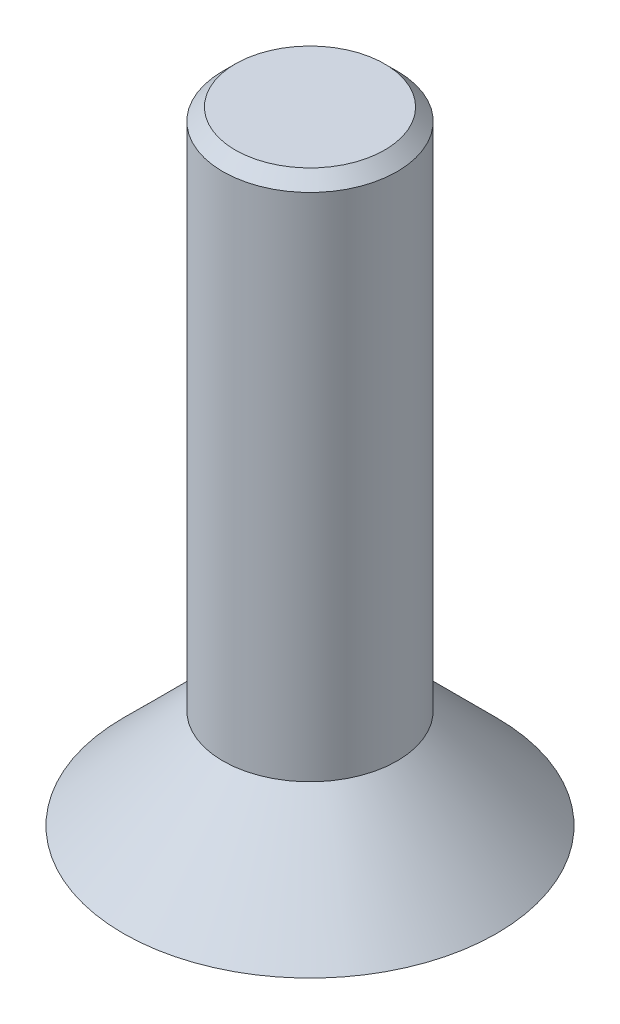
ISO-10303-21;
HEADER;
FILE_DESCRIPTION(('STEP AP214'),'2;1');
FILE_NAME('part.step','',(''),(''),'','','');
FILE_SCHEMA(('AUTOMOTIVE_DESIGN { 1 0 10303 214 1 1 1 1 }'));
ENDSEC;
DATA;
#1=APPLICATION_CONTEXT('core data for automotive mechanical design processes');
#2=APPLICATION_PROTOCOL_DEFINITION('international standard','automotive_design',2000,#1);
#3=PRODUCT_CONTEXT('',#1,'mechanical');
#4=PRODUCT('Part','Part','',(#3));
#5=PRODUCT_RELATED_PRODUCT_CATEGORY('part','',(#4));
#6=PRODUCT_DEFINITION_FORMATION('','',#4);
#7=PRODUCT_DEFINITION_CONTEXT('part definition',#1,'design');
#8=PRODUCT_DEFINITION('design','',#6,#7);
#9=PRODUCT_DEFINITION_SHAPE('','',#8);
#10=(LENGTH_UNIT() NAMED_UNIT(*) SI_UNIT(.MILLI.,.METRE.));
#11=(NAMED_UNIT(*) PLANE_ANGLE_UNIT() SI_UNIT($,.RADIAN.));
#12=(NAMED_UNIT(*) SI_UNIT($,.STERADIAN.) SOLID_ANGLE_UNIT());
#13=UNCERTAINTY_MEASURE_WITH_UNIT(LENGTH_MEASURE(1.E-05),#10,'distance_accuracy_value','');
#14=(GEOMETRIC_REPRESENTATION_CONTEXT(3) GLOBAL_UNCERTAINTY_ASSIGNED_CONTEXT((#13)) GLOBAL_UNIT_ASSIGNED_CONTEXT((#10,
#11,#12)) REPRESENTATION_CONTEXT('',''));
#15=CARTESIAN_POINT('',(0.,0.,0.));
#16=DIRECTION('',(0.,0.,1.));
#17=DIRECTION('',(1.,0.,0.));
#18=AXIS2_PLACEMENT_3D('',#15,#16,#17);
#19=CARTESIAN_POINT('',(0.,0.,0.));
#20=DIRECTION('',(0.,1.,0.));
#21=DIRECTION('',(0.,0.,1.));
#22=AXIS2_PLACEMENT_3D('',#19,#20,#21);
#23=PLANE('',#22);
#24=CARTESIAN_POINT('',(0.,0.,0.));
#25=DIRECTION('',(0.,1.,0.));
#26=DIRECTION('',(0.,0.,1.));
#27=AXIS2_PLACEMENT_3D('',#24,#25,#26);
#28=CIRCLE('',#27,3.);
#29=CARTESIAN_POINT('',(0.,0.,3.));
#30=VERTEX_POINT('',#29);
#31=EDGE_CURVE('E127',#30,#30,#28,.T.);
#32=ORIENTED_EDGE('',*,*,#31,.F.);
#33=EDGE_LOOP('',(#32));
#34=FACE_BOUND('',#33,.T.);
#35=DIRECTION('',(0.866025403784439,0.,0.5));
#36=VECTOR('',#35,1.);
#37=CARTESIAN_POINT('',(-1.,0.,0.577350269189626));
#38=LINE('',#37,#36);
#39=CARTESIAN_POINT('',(-1.,0.,0.577350269189626));
#40=VERTEX_POINT('',#39);
#41=CARTESIAN_POINT('',(0.,0.,1.15470053837925));
#42=VERTEX_POINT('',#41);
#43=EDGE_CURVE('E56',#40,#42,#38,.T.);
#44=ORIENTED_EDGE('',*,*,#43,.T.);
#45=DIRECTION('',(0.866025403784438,0.,-0.5));
#46=VECTOR('',#45,1.);
#47=CARTESIAN_POINT('',(0.,0.,1.15470053837925));
#48=LINE('',#47,#46);
#49=CARTESIAN_POINT('',(1.,0.,0.577350269189626));
#50=VERTEX_POINT('',#49);
#51=EDGE_CURVE('E112',#42,#50,#48,.T.);
#52=ORIENTED_EDGE('',*,*,#51,.T.);
#53=DIRECTION('',(0.,0.,-1.));
#54=VECTOR('',#53,1.);
#55=CARTESIAN_POINT('',(1.,0.,0.577350269189626));
#56=LINE('',#55,#54);
#57=CARTESIAN_POINT('',(0.999999999999999,0.,-0.577350269189626));
#58=VERTEX_POINT('',#57);
#59=EDGE_CURVE('E110',#50,#58,#56,.T.);
#60=ORIENTED_EDGE('',*,*,#59,.T.);
#61=DIRECTION('',(-0.866025403784439,0.,-0.5));
#62=VECTOR('',#61,1.);
#63=CARTESIAN_POINT('',(0.999999999999999,0.,-0.577350269189626));
#64=LINE('',#63,#62);
#65=CARTESIAN_POINT('',(0.,0.,-1.15470053837925));
#66=VERTEX_POINT('',#65);
#67=EDGE_CURVE('E91',#58,#66,#64,.T.);
#68=ORIENTED_EDGE('',*,*,#67,.T.);
#69=DIRECTION('',(-0.866025403784438,0.,0.5));
#70=VECTOR('',#69,1.);
#71=CARTESIAN_POINT('',(0.,0.,-1.15470053837925));
#72=LINE('',#71,#70);
#73=CARTESIAN_POINT('',(-1.,0.,-0.577350269189625));
#74=VERTEX_POINT('',#73);
#75=EDGE_CURVE('E100',#66,#74,#72,.T.);
#76=ORIENTED_EDGE('',*,*,#75,.T.);
#77=DIRECTION('',(0.,0.,1.));
#78=VECTOR('',#77,1.);
#79=CARTESIAN_POINT('',(-1.,0.,-0.577350269189625));
#80=LINE('',#79,#78);
#81=EDGE_CURVE('E106',#74,#40,#80,.T.);
#82=ORIENTED_EDGE('',*,*,#81,.T.);
#83=EDGE_LOOP('',(#44,#52,#60,#68,#76,#82));
#84=FACE_BOUND('',#83,.T.);
#85=ADVANCED_FACE('F40',(#34,#84),#23,.F.);
#86=CARTESIAN_POINT('',(-1.,1.6,0.577350269189626));
#87=DIRECTION('',(0.5,0.,-0.866025403784439));
#88=DIRECTION('',(-0.866025403784439,0.,-0.5));
#89=AXIS2_PLACEMENT_3D('',#86,#87,#88);
#90=PLANE('',#89);
#91=ORIENTED_EDGE('',*,*,#43,.F.);
#92=DIRECTION('',(0.,-1.,0.));
#93=VECTOR('',#92,1.);
#94=CARTESIAN_POINT('',(-1.,1.6,0.577350269189626));
#95=LINE('',#94,#93);
#96=CARTESIAN_POINT('',(-1.,1.6,0.577350269189626));
#97=VERTEX_POINT('',#96);
#98=EDGE_CURVE('E118',#97,#40,#95,.T.);
#99=ORIENTED_EDGE('',*,*,#98,.F.);
#100=DIRECTION('',(0.866025403784439,0.,0.5));
#101=VECTOR('',#100,1.);
#102=CARTESIAN_POINT('',(-1.,1.6,0.577350269189626));
#103=LINE('',#102,#101);
#104=CARTESIAN_POINT('',(0.,1.6,1.15470053837925));
#105=VERTEX_POINT('',#104);
#106=EDGE_CURVE('E117',#97,#105,#103,.T.);
#107=ORIENTED_EDGE('',*,*,#106,.T.);
#108=DIRECTION('',(0.,-1.,0.));
#109=VECTOR('',#108,1.);
#110=CARTESIAN_POINT('',(0.,1.6,1.15470053837925));
#111=LINE('',#110,#109);
#112=EDGE_CURVE('E125',#105,#42,#111,.T.);
#113=ORIENTED_EDGE('',*,*,#112,.T.);
#114=EDGE_LOOP('',(#91,#99,#107,#113));
#115=FACE_BOUND('',#114,.T.);
#116=ADVANCED_FACE('F146',(#115),#90,.T.);
#117=CARTESIAN_POINT('',(0.,1.6,1.15470053837925));
#118=DIRECTION('',(-0.5,0.,-0.866025403784438));
#119=DIRECTION('',(-0.866025403784439,0.,0.5));
#120=AXIS2_PLACEMENT_3D('',#117,#118,#119);
#121=PLANE('',#120);
#122=ORIENTED_EDGE('',*,*,#51,.F.);
#123=ORIENTED_EDGE('',*,*,#112,.F.);
#124=DIRECTION('',(0.866025403784438,0.,-0.5));
#125=VECTOR('',#124,1.);
#126=CARTESIAN_POINT('',(0.,1.6,1.15470053837925));
#127=LINE('',#126,#125);
#128=CARTESIAN_POINT('',(1.,1.6,0.577350269189626));
#129=VERTEX_POINT('',#128);
#130=EDGE_CURVE('E205',#105,#129,#127,.T.);
#131=ORIENTED_EDGE('',*,*,#130,.T.);
#132=DIRECTION('',(0.,-1.,0.));
#133=VECTOR('',#132,1.);
#134=CARTESIAN_POINT('',(1.,1.6,0.577350269189626));
#135=LINE('',#134,#133);
#136=EDGE_CURVE('E123',#129,#50,#135,.T.);
#137=ORIENTED_EDGE('',*,*,#136,.T.);
#138=EDGE_LOOP('',(#122,#123,#131,#137));
#139=FACE_BOUND('',#138,.T.);
#140=ADVANCED_FACE('F152',(#139),#121,.T.);
#141=CARTESIAN_POINT('',(1.,1.6,0.577350269189626));
#142=DIRECTION('',(-1.,0.,0.));
#143=DIRECTION('',(0.,0.,1.));
#144=AXIS2_PLACEMENT_3D('',#141,#142,#143);
#145=PLANE('',#144);
#146=ORIENTED_EDGE('',*,*,#59,.F.);
#147=ORIENTED_EDGE('',*,*,#136,.F.);
#148=DIRECTION('',(0.,0.,-1.));
#149=VECTOR('',#148,1.);
#150=CARTESIAN_POINT('',(1.,1.6,0.577350269189626));
#151=LINE('',#150,#149);
#152=CARTESIAN_POINT('',(0.999999999999999,1.6,-0.577350269189626));
#153=VERTEX_POINT('',#152);
#154=EDGE_CURVE('E203',#129,#153,#151,.T.);
#155=ORIENTED_EDGE('',*,*,#154,.T.);
#156=DIRECTION('',(0.,-1.,0.));
#157=VECTOR('',#156,1.);
#158=CARTESIAN_POINT('',(0.999999999999999,1.6,-0.577350269189626));
#159=LINE('',#158,#157);
#160=EDGE_CURVE('E96',#153,#58,#159,.T.);
#161=ORIENTED_EDGE('',*,*,#160,.T.);
#162=EDGE_LOOP('',(#146,#147,#155,#161));
#163=FACE_BOUND('',#162,.T.);
#164=ADVANCED_FACE('F184',(#163),#145,.T.);
#165=CARTESIAN_POINT('',(0.999999999999999,1.6,-0.577350269189626));
#166=DIRECTION('',(-0.5,0.,0.866025403784439));
#167=DIRECTION('',(0.866025403784439,0.,0.5));
#168=AXIS2_PLACEMENT_3D('',#165,#166,#167);
#169=PLANE('',#168);
#170=ORIENTED_EDGE('',*,*,#67,.F.);
#171=ORIENTED_EDGE('',*,*,#160,.F.);
#172=DIRECTION('',(-0.866025403784439,0.,-0.5));
#173=VECTOR('',#172,1.);
#174=CARTESIAN_POINT('',(0.999999999999999,1.6,-0.577350269189626));
#175=LINE('',#174,#173);
#176=CARTESIAN_POINT('',(0.,1.6,-1.15470053837925));
#177=VERTEX_POINT('',#176);
#178=EDGE_CURVE('E65',#153,#177,#175,.T.);
#179=ORIENTED_EDGE('',*,*,#178,.T.);
#180=DIRECTION('',(0.,-1.,0.));
#181=VECTOR('',#180,1.);
#182=CARTESIAN_POINT('',(0.,1.6,-1.15470053837925));
#183=LINE('',#182,#181);
#184=EDGE_CURVE('E86',#177,#66,#183,.T.);
#185=ORIENTED_EDGE('',*,*,#184,.T.);
#186=EDGE_LOOP('',(#170,#171,#179,#185));
#187=FACE_BOUND('',#186,.T.);
#188=ADVANCED_FACE('F88',(#187),#169,.T.);
#189=CARTESIAN_POINT('',(0.,1.6,-1.15470053837925));
#190=DIRECTION('',(0.5,0.,0.866025403784438));
#191=DIRECTION('',(0.866025403784439,0.,-0.5));
#192=AXIS2_PLACEMENT_3D('',#189,#190,#191);
#193=PLANE('',#192);
#194=ORIENTED_EDGE('',*,*,#75,.F.);
#195=ORIENTED_EDGE('',*,*,#184,.F.);
#196=DIRECTION('',(-0.866025403784438,0.,0.5));
#197=VECTOR('',#196,1.);
#198=CARTESIAN_POINT('',(0.,1.6,-1.15470053837925));
#199=LINE('',#198,#197);
#200=CARTESIAN_POINT('',(-1.,1.6,-0.577350269189625));
#201=VERTEX_POINT('',#200);
#202=EDGE_CURVE('E200',#177,#201,#199,.T.);
#203=ORIENTED_EDGE('',*,*,#202,.T.);
#204=DIRECTION('',(0.,-1.,0.));
#205=VECTOR('',#204,1.);
#206=CARTESIAN_POINT('',(-1.,1.6,-0.577350269189625));
#207=LINE('',#206,#205);
#208=EDGE_CURVE('E97',#201,#74,#207,.T.);
#209=ORIENTED_EDGE('',*,*,#208,.T.);
#210=EDGE_LOOP('',(#194,#195,#203,#209));
#211=FACE_BOUND('',#210,.T.);
#212=ADVANCED_FACE('F101',(#211),#193,.T.);
#213=CARTESIAN_POINT('',(-1.,1.6,-0.577350269189625));
#214=DIRECTION('',(1.,0.,0.));
#215=DIRECTION('',(0.,0.,-1.));
#216=AXIS2_PLACEMENT_3D('',#213,#214,#215);
#217=PLANE('',#216);
#218=ORIENTED_EDGE('',*,*,#81,.F.);
#219=ORIENTED_EDGE('',*,*,#208,.F.);
#220=DIRECTION('',(0.,0.,1.));
#221=VECTOR('',#220,1.);
#222=CARTESIAN_POINT('',(-1.,1.6,-0.577350269189625));
#223=LINE('',#222,#221);
#224=EDGE_CURVE('E120',#201,#97,#223,.T.);
#225=ORIENTED_EDGE('',*,*,#224,.T.);
#226=ORIENTED_EDGE('',*,*,#98,.T.);
#227=EDGE_LOOP('',(#218,#219,#225,#226));
#228=FACE_BOUND('',#227,.T.);
#229=ADVANCED_FACE('F162',(#228),#217,.T.);
#230=CARTESIAN_POINT('',(0.,1.6,0.));
#231=DIRECTION('',(0.,-1.,0.));
#232=DIRECTION('',(0.,0.,-1.));
#233=AXIS2_PLACEMENT_3D('',#230,#231,#232);
#234=CONICAL_SURFACE('',#233,1.4,0.785398163397447);
#235=ORIENTED_EDGE('',*,*,#31,.T.);
#236=EDGE_LOOP('',(#235));
#237=FACE_BOUND('',#236,.T.);
#238=CARTESIAN_POINT('',(0.,1.6,0.));
#239=DIRECTION('',(0.,1.,0.));
#240=DIRECTION('',(0.,0.,1.));
#241=AXIS2_PLACEMENT_3D('',#238,#239,#240);
#242=CIRCLE('',#241,1.4);
#243=CARTESIAN_POINT('',(0.,1.6,1.4));
#244=VERTEX_POINT('',#243);
#245=EDGE_CURVE('E130',#244,#244,#242,.T.);
#246=ORIENTED_EDGE('',*,*,#245,.F.);
#247=EDGE_LOOP('',(#246));
#248=FACE_BOUND('',#247,.T.);
#249=ADVANCED_FACE('F157',(#237,#248),#234,.T.);
#250=CARTESIAN_POINT('',(0.,1.6,0.));
#251=DIRECTION('',(0.,1.,0.));
#252=DIRECTION('',(0.,0.,1.));
#253=AXIS2_PLACEMENT_3D('',#250,#251,#252);
#254=PLANE('',#253);
#255=ORIENTED_EDGE('',*,*,#130,.F.);
#256=ORIENTED_EDGE('',*,*,#106,.F.);
#257=ORIENTED_EDGE('',*,*,#224,.F.);
#258=ORIENTED_EDGE('',*,*,#202,.F.);
#259=ORIENTED_EDGE('',*,*,#178,.F.);
#260=ORIENTED_EDGE('',*,*,#154,.F.);
#261=EDGE_LOOP('',(#255,#256,#257,#258,#259,#260));
#262=FACE_BOUND('',#261,.T.);
#263=ADVANCED_FACE('F161',(#262),#254,.F.);
#264=CARTESIAN_POINT('',(0.,10.,0.));
#265=DIRECTION('',(0.,-1.,0.));
#266=DIRECTION('',(0.,0.,-1.));
#267=AXIS2_PLACEMENT_3D('',#264,#265,#266);
#268=CYLINDRICAL_SURFACE('',#267,1.4);
#269=CARTESIAN_POINT('',(0.,9.8,0.));
#270=DIRECTION('',(0.,1.,0.));
#271=DIRECTION('',(0.,0.,1.));
#272=AXIS2_PLACEMENT_3D('',#269,#270,#271);
#273=CIRCLE('',#272,1.4);
#274=CARTESIAN_POINT('',(0.,9.8,1.4));
#275=VERTEX_POINT('',#274);
#276=EDGE_CURVE('E11',#275,#275,#273,.F.);
#277=ORIENTED_EDGE('',*,*,#276,.T.);
#278=EDGE_LOOP('',(#277));
#279=FACE_BOUND('',#278,.T.);
#280=ORIENTED_EDGE('',*,*,#245,.T.);
#281=EDGE_LOOP('',(#280));
#282=FACE_BOUND('',#281,.T.);
#283=ADVANCED_FACE('F142',(#279,#282),#268,.T.);
#284=CARTESIAN_POINT('',(0.,10.,0.));
#285=DIRECTION('',(0.,1.,0.));
#286=DIRECTION('',(0.,0.,1.));
#287=AXIS2_PLACEMENT_3D('',#284,#285,#286);
#288=PLANE('',#287);
#289=CARTESIAN_POINT('',(0.,10.,0.));
#290=DIRECTION('',(0.,1.,0.));
#291=DIRECTION('',(0.,0.,1.));
#292=AXIS2_PLACEMENT_3D('',#289,#290,#291);
#293=CIRCLE('',#292,1.2);
#294=CARTESIAN_POINT('',(0.,10.,1.2));
#295=VERTEX_POINT('',#294);
#296=EDGE_CURVE('E49',#295,#295,#293,.T.);
#297=ORIENTED_EDGE('',*,*,#296,.T.);
#298=EDGE_LOOP('',(#297));
#299=FACE_BOUND('',#298,.T.);
#300=ADVANCED_FACE('F135',(#299),#288,.T.);
#301=CARTESIAN_POINT('',(0.,10.,0.));
#302=DIRECTION('',(0.,-1.,0.));
#303=DIRECTION('',(0.,0.,-1.));
#304=AXIS2_PLACEMENT_3D('',#301,#302,#303);
#305=CONICAL_SURFACE('',#304,1.2,0.785398163397444);
#306=ORIENTED_EDGE('',*,*,#276,.F.);
#307=EDGE_LOOP('',(#306));
#308=FACE_BOUND('',#307,.T.);
#309=ORIENTED_EDGE('',*,*,#296,.F.);
#310=EDGE_LOOP('',(#309));
#311=FACE_BOUND('',#310,.T.);
#312=ADVANCED_FACE('F43',(#308,#311),#305,.T.);
#313=CLOSED_SHELL('',(#85,#116,#140,#164,#188,#212,#229,#249,#263,#283,#300,#312));
#314=MANIFOLD_SOLID_BREP('B2',#313);
#315=ADVANCED_BREP_SHAPE_REPRESENTATION('',(#18,#314),#14);
#316=SHAPE_DEFINITION_REPRESENTATION(#9,#315);
ENDSEC;
END-ISO-10303-21;
